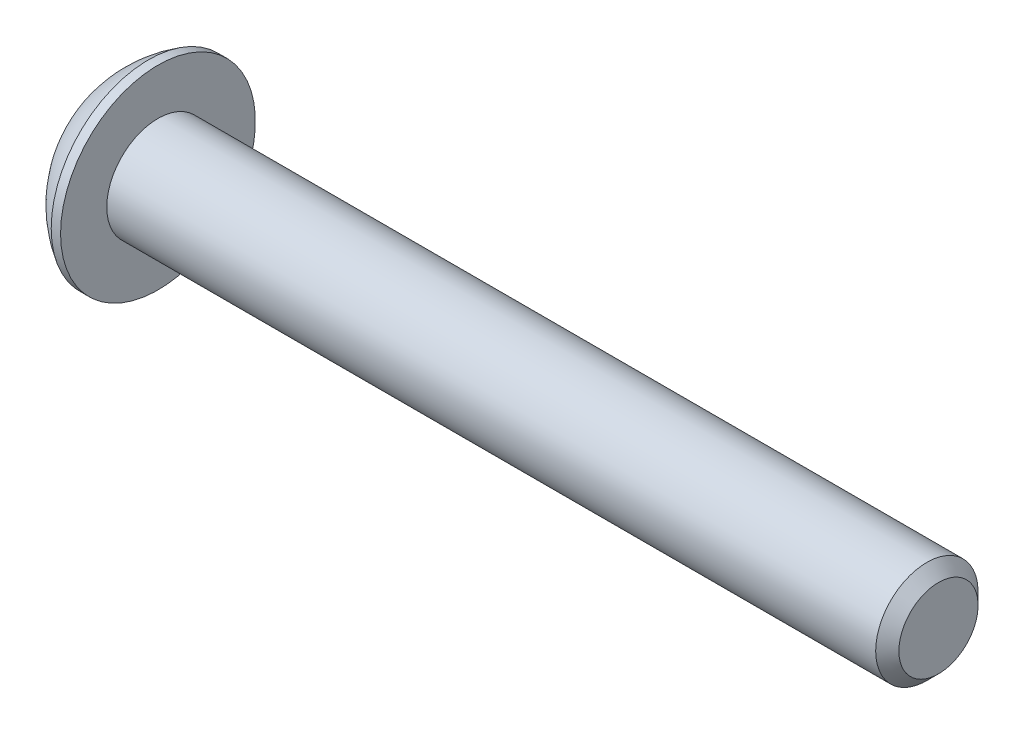
ISO-10303-21;
HEADER;
FILE_DESCRIPTION(('STEP AP214'),'2;1');
FILE_NAME('part.step','',(''),(''),'','','');
FILE_SCHEMA(('AUTOMOTIVE_DESIGN { 1 0 10303 214 1 1 1 1 }'));
ENDSEC;
DATA;
#1=APPLICATION_CONTEXT('core data for automotive mechanical design processes');
#2=APPLICATION_PROTOCOL_DEFINITION('international standard','automotive_design',2000,#1);
#3=PRODUCT_CONTEXT('',#1,'mechanical');
#4=PRODUCT('Part','Part','',(#3));
#5=PRODUCT_RELATED_PRODUCT_CATEGORY('part','',(#4));
#6=PRODUCT_DEFINITION_FORMATION('','',#4);
#7=PRODUCT_DEFINITION_CONTEXT('part definition',#1,'design');
#8=PRODUCT_DEFINITION('design','',#6,#7);
#9=PRODUCT_DEFINITION_SHAPE('','',#8);
#10=(LENGTH_UNIT() NAMED_UNIT(*) SI_UNIT(.MILLI.,.METRE.));
#11=(NAMED_UNIT(*) PLANE_ANGLE_UNIT() SI_UNIT($,.RADIAN.));
#12=(NAMED_UNIT(*) SI_UNIT($,.STERADIAN.) SOLID_ANGLE_UNIT());
#13=UNCERTAINTY_MEASURE_WITH_UNIT(LENGTH_MEASURE(1.E-05),#10,'distance_accuracy_value','');
#14=(GEOMETRIC_REPRESENTATION_CONTEXT(3) GLOBAL_UNCERTAINTY_ASSIGNED_CONTEXT((#13)) GLOBAL_UNIT_ASSIGNED_CONTEXT((#10,
#11,#12)) REPRESENTATION_CONTEXT('',''));
#15=CARTESIAN_POINT('',(0.,0.,0.));
#16=DIRECTION('',(0.,0.,1.));
#17=DIRECTION('',(1.,0.,0.));
#18=AXIS2_PLACEMENT_3D('',#15,#16,#17);
#19=CARTESIAN_POINT('',(1.32079999997359,0.,0.));
#20=DIRECTION('',(-1.,0.,0.));
#21=DIRECTION('',(0.,0.,1.));
#22=AXIS2_PLACEMENT_3D('',#19,#20,#21);
#23=CONICAL_SURFACE('',#22,1.19380000001001,1.04719755119008);
#24=CARTESIAN_POINT('',(2.0100407513155,0.,0.));
#25=VERTEX_POINT('',#24);
#26=VERTEX_LOOP('',#25);
#27=FACE_BOUND('',#26,.T.);
#28=CARTESIAN_POINT('',(1.32079999997359,0.,0.));
#29=DIRECTION('',(-1.,0.,0.));
#30=DIRECTION('',(0.,0.,1.));
#31=AXIS2_PLACEMENT_3D('',#28,#29,#30);
#32=CIRCLE('',#31,1.19380000001001);
#33=CARTESIAN_POINT('',(1.32079999998682,-1.0338611270422,0.596900000002503));
#34=VERTEX_POINT('',#33);
#35=CARTESIAN_POINT('',(1.32079999998682,0.,1.19380000000501));
#36=VERTEX_POINT('',#35);
#37=EDGE_CURVE('E92',#34,#36,#32,.T.);
#38=ORIENTED_EDGE('',*,*,#37,.T.);
#39=CARTESIAN_POINT('',(1.32079999997359,0.,0.));
#40=DIRECTION('',(-1.,0.,0.));
#41=DIRECTION('',(0.,0.,1.));
#42=AXIS2_PLACEMENT_3D('',#39,#40,#41);
#43=CIRCLE('',#42,1.19380000001001);
#44=CARTESIAN_POINT('',(1.32079999998682,1.0338611270422,0.596900000002504));
#45=VERTEX_POINT('',#44);
#46=EDGE_CURVE('E88',#36,#45,#43,.T.);
#47=ORIENTED_EDGE('',*,*,#46,.T.);
#48=CARTESIAN_POINT('',(1.32079999997359,0.,0.));
#49=DIRECTION('',(-1.,0.,0.));
#50=DIRECTION('',(0.,0.,1.));
#51=AXIS2_PLACEMENT_3D('',#48,#49,#50);
#52=CIRCLE('',#51,1.19380000001001);
#53=CARTESIAN_POINT('',(1.32079999998682,1.0338611270422,-0.596900000002504));
#54=VERTEX_POINT('',#53);
#55=EDGE_CURVE('E21',#45,#54,#52,.T.);
#56=ORIENTED_EDGE('',*,*,#55,.T.);
#57=CARTESIAN_POINT('',(1.32079999997359,0.,0.));
#58=DIRECTION('',(-1.,0.,0.));
#59=DIRECTION('',(0.,0.,1.));
#60=AXIS2_PLACEMENT_3D('',#57,#58,#59);
#61=CIRCLE('',#60,1.19380000001001);
#62=CARTESIAN_POINT('',(1.32079999998682,1.49461108489558E-12,-1.19380000000501));
#63=VERTEX_POINT('',#62);
#64=EDGE_CURVE('E151',#54,#63,#61,.T.);
#65=ORIENTED_EDGE('',*,*,#64,.T.);
#66=CARTESIAN_POINT('',(1.32079999997359,0.,0.));
#67=DIRECTION('',(-1.,0.,0.));
#68=DIRECTION('',(0.,0.,1.));
#69=AXIS2_PLACEMENT_3D('',#66,#67,#68);
#70=CIRCLE('',#69,1.19380000001001);
#71=CARTESIAN_POINT('',(1.32079999998682,-1.0338611270422,-0.596900000002503));
#72=VERTEX_POINT('',#71);
#73=EDGE_CURVE('E153',#63,#72,#70,.T.);
#74=ORIENTED_EDGE('',*,*,#73,.T.);
#75=CARTESIAN_POINT('',(1.32079999997359,0.,0.));
#76=DIRECTION('',(-1.,0.,0.));
#77=DIRECTION('',(0.,0.,1.));
#78=AXIS2_PLACEMENT_3D('',#75,#76,#77);
#79=CIRCLE('',#78,1.19380000001001);
#80=EDGE_CURVE('E155',#72,#34,#79,.T.);
#81=ORIENTED_EDGE('',*,*,#80,.T.);
#82=EDGE_LOOP('',(#38,#47,#56,#65,#74,#81));
#83=FACE_BOUND('',#82,.T.);
#84=ADVANCED_FACE('F17',(#27,#83),#23,.F.);
#85=CARTESIAN_POINT('',(1.3208,-2.06772225407572,-1.1938));
#86=DIRECTION('',(1.,0.,0.));
#87=DIRECTION('',(0.,0.,-1.));
#88=AXIS2_PLACEMENT_3D('',#85,#86,#87);
#89=PLANE('',#88);
#90=DIRECTION('',(0.,-0.5,-0.866025403784439));
#91=VECTOR('',#90,1.);
#92=CARTESIAN_POINT('',(1.32080000000004,1.37848150271715,0.));
#93=LINE('',#92,#91);
#94=CARTESIAN_POINT('',(1.32080000000001,1.37848150271715,0.));
#95=VERTEX_POINT('',#94);
#96=EDGE_CURVE('E104',#54,#95,#93,.F.);
#97=ORIENTED_EDGE('',*,*,#96,.F.);
#98=ORIENTED_EDGE('',*,*,#55,.F.);
#99=DIRECTION('',(0.,0.5,-0.866025403784439));
#100=VECTOR('',#99,1.);
#101=CARTESIAN_POINT('',(1.3208,0.689240751358576,1.1938));
#102=LINE('',#101,#100);
#103=EDGE_CURVE('E102',#95,#45,#102,.F.);
#104=ORIENTED_EDGE('',*,*,#103,.F.);
#105=EDGE_LOOP('',(#97,#98,#104));
#106=FACE_BOUND('',#105,.T.);
#107=ADVANCED_FACE('F100',(#106),#89,.F.);
#108=CARTESIAN_POINT('',(1.3208,-2.06772225407572,-1.1938));
#109=DIRECTION('',(1.,0.,0.));
#110=DIRECTION('',(0.,0.,-1.));
#111=AXIS2_PLACEMENT_3D('',#108,#109,#110);
#112=PLANE('',#111);
#113=DIRECTION('',(0.,0.5,-0.866025403784439));
#114=VECTOR('',#113,1.);
#115=CARTESIAN_POINT('',(1.32080000000004,0.689240751358576,1.1938));
#116=LINE('',#115,#114);
#117=CARTESIAN_POINT('',(1.32080000000001,0.689240751358576,1.1938));
#118=VERTEX_POINT('',#117);
#119=EDGE_CURVE('E106',#45,#118,#116,.F.);
#120=ORIENTED_EDGE('',*,*,#119,.F.);
#121=ORIENTED_EDGE('',*,*,#46,.F.);
#122=DIRECTION('',(0.,1.,0.));
#123=VECTOR('',#122,1.);
#124=CARTESIAN_POINT('',(1.3208,-0.689240751358574,1.1938));
#125=LINE('',#124,#123);
#126=EDGE_CURVE('E109',#118,#36,#125,.F.);
#127=ORIENTED_EDGE('',*,*,#126,.F.);
#128=EDGE_LOOP('',(#120,#121,#127));
#129=FACE_BOUND('',#128,.T.);
#130=ADVANCED_FACE('F107',(#129),#112,.F.);
#131=CARTESIAN_POINT('',(1.3208,-2.06772225407572,-1.1938));
#132=DIRECTION('',(1.,0.,0.));
#133=DIRECTION('',(0.,0.,-1.));
#134=AXIS2_PLACEMENT_3D('',#131,#132,#133);
#135=PLANE('',#134);
#136=DIRECTION('',(0.,1.,0.));
#137=VECTOR('',#136,1.);
#138=CARTESIAN_POINT('',(1.32080000000004,-0.689240751358574,1.1938));
#139=LINE('',#138,#137);
#140=CARTESIAN_POINT('',(1.32080000000001,-0.689240751358574,1.1938));
#141=VERTEX_POINT('',#140);
#142=EDGE_CURVE('E169',#36,#141,#139,.F.);
#143=ORIENTED_EDGE('',*,*,#142,.F.);
#144=ORIENTED_EDGE('',*,*,#37,.F.);
#145=DIRECTION('',(0.,0.5,0.866025403784439));
#146=VECTOR('',#145,1.);
#147=CARTESIAN_POINT('',(1.3208,-1.37848150271715,0.));
#148=LINE('',#147,#146);
#149=EDGE_CURVE('E167',#141,#34,#148,.F.);
#150=ORIENTED_EDGE('',*,*,#149,.F.);
#151=EDGE_LOOP('',(#143,#144,#150));
#152=FACE_BOUND('',#151,.T.);
#153=ADVANCED_FACE('F165',(#152),#135,.F.);
#154=CARTESIAN_POINT('',(1.3208,-2.06772225407572,-1.1938));
#155=DIRECTION('',(1.,0.,0.));
#156=DIRECTION('',(0.,0.,-1.));
#157=AXIS2_PLACEMENT_3D('',#154,#155,#156);
#158=PLANE('',#157);
#159=DIRECTION('',(0.,0.5,0.866025403784439));
#160=VECTOR('',#159,1.);
#161=CARTESIAN_POINT('',(1.32080000000004,-1.37848150271715,0.));
#162=LINE('',#161,#160);
#163=CARTESIAN_POINT('',(1.32080000000001,-1.37848150271715,0.));
#164=VERTEX_POINT('',#163);
#165=EDGE_CURVE('E170',#34,#164,#162,.F.);
#166=ORIENTED_EDGE('',*,*,#165,.F.);
#167=ORIENTED_EDGE('',*,*,#80,.F.);
#168=DIRECTION('',(0.,-0.5,0.866025403784439));
#169=VECTOR('',#168,1.);
#170=CARTESIAN_POINT('',(1.3208,-0.689240751358574,-1.1938));
#171=LINE('',#170,#169);
#172=EDGE_CURVE('E173',#164,#72,#171,.F.);
#173=ORIENTED_EDGE('',*,*,#172,.F.);
#174=EDGE_LOOP('',(#166,#167,#173));
#175=FACE_BOUND('',#174,.T.);
#176=ADVANCED_FACE('F171',(#175),#158,.F.);
#177=CARTESIAN_POINT('',(1.3208,-2.06772225407572,-1.1938));
#178=DIRECTION('',(1.,0.,0.));
#179=DIRECTION('',(0.,0.,-1.));
#180=AXIS2_PLACEMENT_3D('',#177,#178,#179);
#181=PLANE('',#180);
#182=DIRECTION('',(0.,-0.5,0.866025403784439));
#183=VECTOR('',#182,1.);
#184=CARTESIAN_POINT('',(1.32080000000004,-0.689240751358574,-1.1938));
#185=LINE('',#184,#183);
#186=CARTESIAN_POINT('',(1.32080000000001,-0.689240751358574,-1.1938));
#187=VERTEX_POINT('',#186);
#188=EDGE_CURVE('E228',#72,#187,#185,.F.);
#189=ORIENTED_EDGE('',*,*,#188,.F.);
#190=ORIENTED_EDGE('',*,*,#73,.F.);
#191=DIRECTION('',(0.,1.,0.));
#192=VECTOR('',#191,1.);
#193=CARTESIAN_POINT('',(1.3208,0.689240751358577,-1.1938));
#194=LINE('',#193,#192);
#195=EDGE_CURVE('E240',#187,#63,#194,.T.);
#196=ORIENTED_EDGE('',*,*,#195,.F.);
#197=EDGE_LOOP('',(#189,#190,#196));
#198=FACE_BOUND('',#197,.T.);
#199=ADVANCED_FACE('F390',(#198),#181,.F.);
#200=CARTESIAN_POINT('',(1.3208,-2.06772225407572,-1.1938));
#201=DIRECTION('',(1.,0.,0.));
#202=DIRECTION('',(0.,0.,-1.));
#203=AXIS2_PLACEMENT_3D('',#200,#201,#202);
#204=PLANE('',#203);
#205=DIRECTION('',(0.,1.,0.));
#206=VECTOR('',#205,1.);
#207=CARTESIAN_POINT('',(1.32080000000004,0.689240751358577,-1.1938));
#208=LINE('',#207,#206);
#209=CARTESIAN_POINT('',(1.32080000000002,0.689240751358565,-1.19380000000002));
#210=VERTEX_POINT('',#209);
#211=EDGE_CURVE('E248',#63,#210,#208,.T.);
#212=ORIENTED_EDGE('',*,*,#211,.F.);
#213=ORIENTED_EDGE('',*,*,#64,.F.);
#214=DIRECTION('',(0.,-0.5,-0.866025403784439));
#215=VECTOR('',#214,1.);
#216=CARTESIAN_POINT('',(1.3208,1.37848150271715,0.));
#217=LINE('',#216,#215);
#218=EDGE_CURVE('E128',#210,#54,#217,.F.);
#219=ORIENTED_EDGE('',*,*,#218,.F.);
#220=EDGE_LOOP('',(#212,#213,#219));
#221=FACE_BOUND('',#220,.T.);
#222=ADVANCED_FACE('F380',(#221),#204,.F.);
#223=CARTESIAN_POINT('',(1.3208,1.37848150271715,0.));
#224=DIRECTION('',(0.,-0.866025403784439,0.5));
#225=DIRECTION('',(0.,-0.5,-0.866025403784439));
#226=AXIS2_PLACEMENT_3D('',#223,#224,#225);
#227=PLANE('',#226);
#228=ORIENTED_EDGE('',*,*,#96,.T.);
#229=DIRECTION('',(1.,0.,0.));
#230=VECTOR('',#229,1.);
#231=CARTESIAN_POINT('',(1.3208,1.37848150271715,0.));
#232=LINE('',#231,#230);
#233=CARTESIAN_POINT('',(0.,1.37848150271715,0.));
#234=VERTEX_POINT('',#233);
#235=EDGE_CURVE('E116',#234,#95,#232,.T.);
#236=ORIENTED_EDGE('',*,*,#235,.F.);
#237=DIRECTION('',(0.,0.5,0.866025403784439));
#238=VECTOR('',#237,1.);
#239=CARTESIAN_POINT('',(0.,0.689240751358577,-1.1938));
#240=LINE('',#239,#238);
#241=CARTESIAN_POINT('',(0.,0.689240751358577,-1.1938));
#242=VERTEX_POINT('',#241);
#243=EDGE_CURVE('E131',#242,#234,#240,.T.);
#244=ORIENTED_EDGE('',*,*,#243,.F.);
#245=DIRECTION('',(1.,0.,0.));
#246=VECTOR('',#245,1.);
#247=CARTESIAN_POINT('',(1.3208,0.689240751358577,-1.1938));
#248=LINE('',#247,#246);
#249=EDGE_CURVE('E135',#210,#242,#248,.F.);
#250=ORIENTED_EDGE('',*,*,#249,.F.);
#251=ORIENTED_EDGE('',*,*,#218,.T.);
#252=EDGE_LOOP('',(#228,#236,#244,#250,#251));
#253=FACE_BOUND('',#252,.T.);
#254=ADVANCED_FACE('F371',(#253),#227,.T.);
#255=CARTESIAN_POINT('',(1.3208,0.689240751358576,1.1938));
#256=DIRECTION('',(0.,-0.866025403784439,-0.5));
#257=DIRECTION('',(0.,0.5,-0.866025403784439));
#258=AXIS2_PLACEMENT_3D('',#255,#256,#257);
#259=PLANE('',#258);
#260=ORIENTED_EDGE('',*,*,#119,.T.);
#261=DIRECTION('',(1.,0.,0.));
#262=VECTOR('',#261,1.);
#263=CARTESIAN_POINT('',(1.3208,0.689240751358576,1.1938));
#264=LINE('',#263,#262);
#265=CARTESIAN_POINT('',(0.,0.689240751358577,1.1938));
#266=VERTEX_POINT('',#265);
#267=EDGE_CURVE('E112',#266,#118,#264,.T.);
#268=ORIENTED_EDGE('',*,*,#267,.F.);
#269=DIRECTION('',(0.,-0.5,0.866025403784439));
#270=VECTOR('',#269,1.);
#271=CARTESIAN_POINT('',(0.,1.37848150271715,0.));
#272=LINE('',#271,#270);
#273=EDGE_CURVE('E134',#234,#266,#272,.T.);
#274=ORIENTED_EDGE('',*,*,#273,.F.);
#275=ORIENTED_EDGE('',*,*,#235,.T.);
#276=ORIENTED_EDGE('',*,*,#103,.T.);
#277=EDGE_LOOP('',(#260,#268,#274,#275,#276));
#278=FACE_BOUND('',#277,.T.);
#279=ADVANCED_FACE('F114',(#278),#259,.T.);
#280=CARTESIAN_POINT('',(1.3208,-0.689240751358574,1.1938));
#281=DIRECTION('',(0.,0.,-1.));
#282=DIRECTION('',(0.,1.,0.));
#283=AXIS2_PLACEMENT_3D('',#280,#281,#282);
#284=PLANE('',#283);
#285=ORIENTED_EDGE('',*,*,#142,.T.);
#286=DIRECTION('',(1.,0.,0.));
#287=VECTOR('',#286,1.);
#288=CARTESIAN_POINT('',(1.3208,-0.689240751358574,1.1938));
#289=LINE('',#288,#287);
#290=CARTESIAN_POINT('',(0.,-0.689240751358574,1.1938));
#291=VERTEX_POINT('',#290);
#292=EDGE_CURVE('E180',#291,#141,#289,.T.);
#293=ORIENTED_EDGE('',*,*,#292,.F.);
#294=DIRECTION('',(0.,1.,0.));
#295=VECTOR('',#294,1.);
#296=CARTESIAN_POINT('',(0.,0.,1.1938));
#297=LINE('',#296,#295);
#298=EDGE_CURVE('E194',#266,#291,#297,.F.);
#299=ORIENTED_EDGE('',*,*,#298,.F.);
#300=ORIENTED_EDGE('',*,*,#267,.T.);
#301=ORIENTED_EDGE('',*,*,#126,.T.);
#302=EDGE_LOOP('',(#285,#293,#299,#300,#301));
#303=FACE_BOUND('',#302,.T.);
#304=ADVANCED_FACE('F216',(#303),#284,.T.);
#305=CARTESIAN_POINT('',(1.3208,-1.37848150271715,0.));
#306=DIRECTION('',(0.,0.866025403784439,-0.5));
#307=DIRECTION('',(0.,0.5,0.866025403784439));
#308=AXIS2_PLACEMENT_3D('',#305,#306,#307);
#309=PLANE('',#308);
#310=ORIENTED_EDGE('',*,*,#165,.T.);
#311=DIRECTION('',(1.,0.,0.));
#312=VECTOR('',#311,1.);
#313=CARTESIAN_POINT('',(1.3208,-1.37848150271715,0.));
#314=LINE('',#313,#312);
#315=CARTESIAN_POINT('',(0.,-1.37848150271715,0.));
#316=VERTEX_POINT('',#315);
#317=EDGE_CURVE('E176',#316,#164,#314,.T.);
#318=ORIENTED_EDGE('',*,*,#317,.F.);
#319=DIRECTION('',(0.,-0.5,-0.866025403784439));
#320=VECTOR('',#319,1.);
#321=CARTESIAN_POINT('',(0.,-0.689240751358574,1.1938));
#322=LINE('',#321,#320);
#323=EDGE_CURVE('E197',#291,#316,#322,.T.);
#324=ORIENTED_EDGE('',*,*,#323,.F.);
#325=ORIENTED_EDGE('',*,*,#292,.T.);
#326=ORIENTED_EDGE('',*,*,#149,.T.);
#327=EDGE_LOOP('',(#310,#318,#324,#325,#326));
#328=FACE_BOUND('',#327,.T.);
#329=ADVANCED_FACE('F178',(#328),#309,.T.);
#330=CARTESIAN_POINT('',(1.3208,-0.689240751358574,-1.1938));
#331=DIRECTION('',(0.,0.866025403784439,0.5));
#332=DIRECTION('',(0.,-0.5,0.866025403784439));
#333=AXIS2_PLACEMENT_3D('',#330,#331,#332);
#334=PLANE('',#333);
#335=ORIENTED_EDGE('',*,*,#188,.T.);
#336=DIRECTION('',(1.,0.,0.));
#337=VECTOR('',#336,1.);
#338=CARTESIAN_POINT('',(1.3208,-0.689240751358574,-1.1938));
#339=LINE('',#338,#337);
#340=CARTESIAN_POINT('',(0.,-0.689240751358574,-1.1938));
#341=VERTEX_POINT('',#340);
#342=EDGE_CURVE('E36',#341,#187,#339,.T.);
#343=ORIENTED_EDGE('',*,*,#342,.F.);
#344=DIRECTION('',(0.,0.5,-0.866025403784439));
#345=VECTOR('',#344,1.);
#346=CARTESIAN_POINT('',(0.,-1.37848150271715,0.));
#347=LINE('',#346,#345);
#348=EDGE_CURVE('E217',#316,#341,#347,.T.);
#349=ORIENTED_EDGE('',*,*,#348,.F.);
#350=ORIENTED_EDGE('',*,*,#317,.T.);
#351=ORIENTED_EDGE('',*,*,#172,.T.);
#352=EDGE_LOOP('',(#335,#343,#349,#350,#351));
#353=FACE_BOUND('',#352,.T.);
#354=ADVANCED_FACE('F337',(#353),#334,.T.);
#355=CARTESIAN_POINT('',(1.3208,0.689240751358577,-1.1938));
#356=DIRECTION('',(0.,0.,1.));
#357=DIRECTION('',(1.,0.,0.));
#358=AXIS2_PLACEMENT_3D('',#355,#356,#357);
#359=PLANE('',#358);
#360=ORIENTED_EDGE('',*,*,#211,.T.);
#361=ORIENTED_EDGE('',*,*,#249,.T.);
#362=DIRECTION('',(0.,1.,0.));
#363=VECTOR('',#362,1.);
#364=CARTESIAN_POINT('',(0.,0.,-1.1938));
#365=LINE('',#364,#363);
#366=EDGE_CURVE('E150',#341,#242,#365,.T.);
#367=ORIENTED_EDGE('',*,*,#366,.F.);
#368=ORIENTED_EDGE('',*,*,#342,.T.);
#369=ORIENTED_EDGE('',*,*,#195,.T.);
#370=EDGE_LOOP('',(#360,#361,#367,#368,#369));
#371=FACE_BOUND('',#370,.T.);
#372=ADVANCED_FACE('F328',(#371),#359,.T.);
#373=CARTESIAN_POINT('',(0.,0.,0.));
#374=DIRECTION('',(-1.,0.,0.));
#375=DIRECTION('',(0.,0.,1.));
#376=AXIS2_PLACEMENT_3D('',#373,#374,#375);
#377=PLANE('',#376);
#378=CARTESIAN_POINT('',(0.,0.,0.));
#379=DIRECTION('',(-1.,0.,0.));
#380=DIRECTION('',(0.,0.,1.));
#381=AXIS2_PLACEMENT_3D('',#378,#379,#380);
#382=CIRCLE('',#381,1.9812);
#383=CARTESIAN_POINT('',(0.,0.,1.9812));
#384=VERTEX_POINT('',#383);
#385=EDGE_CURVE('E147',#384,#384,#382,.F.);
#386=ORIENTED_EDGE('',*,*,#385,.F.);
#387=EDGE_LOOP('',(#386));
#388=FACE_BOUND('',#387,.T.);
#389=ORIENTED_EDGE('',*,*,#348,.T.);
#390=ORIENTED_EDGE('',*,*,#366,.T.);
#391=ORIENTED_EDGE('',*,*,#243,.T.);
#392=ORIENTED_EDGE('',*,*,#273,.T.);
#393=ORIENTED_EDGE('',*,*,#298,.T.);
#394=ORIENTED_EDGE('',*,*,#323,.T.);
#395=EDGE_LOOP('',(#389,#390,#391,#392,#393,#394));
#396=FACE_BOUND('',#395,.T.);
#397=ADVANCED_FACE('F210',(#388,#396),#377,.T.);
#398=CARTESIAN_POINT('',(4.13385,0.,0.));
#399=DIRECTION('',(0.,1.,0.));
#400=DIRECTION('',(-0.491969836603489,0.,-0.870612244269707));
#401=AXIS2_PLACEMENT_3D('',#398,#399,#400);
#402=SPHERICAL_SURFACE('',#401,4.58408870578439);
#403=CARTESIAN_POINT('',(4.13385,0.,0.));
#404=DIRECTION('',(-1.,0.,0.));
#405=DIRECTION('',(0.,0.,1.));
#406=AXIS2_PLACEMENT_3D('',#403,#404,#405);
#407=SPHERICAL_SURFACE('',#406,4.58408870578439);
#408=ORIENTED_EDGE('',*,*,#385,.T.);
#409=EDGE_LOOP('',(#408));
#410=FACE_BOUND('',#409,.T.);
#411=CARTESIAN_POINT('',(1.8288,0.,0.));
#412=DIRECTION('',(-1.,0.,0.));
#413=DIRECTION('',(0.,0.,1.));
#414=AXIS2_PLACEMENT_3D('',#411,#412,#413);
#415=CIRCLE('',#414,3.9624);
#416=CARTESIAN_POINT('',(1.8288,0.,3.9624));
#417=VERTEX_POINT('',#416);
#418=EDGE_CURVE('E144',#417,#417,#415,.F.);
#419=ORIENTED_EDGE('',*,*,#418,.F.);
#420=EDGE_LOOP('',(#419));
#421=FACE_BOUND('',#420,.T.);
#422=ADVANCED_FACE('F19',(#410,#421),#407,.T.);
#423=CARTESIAN_POINT('',(33.9598,0.,0.));
#424=DIRECTION('',(-1.,0.,0.));
#425=DIRECTION('',(0.,0.,1.));
#426=AXIS2_PLACEMENT_3D('',#423,#424,#425);
#427=PLANE('',#426);
#428=CARTESIAN_POINT('',(33.959799999991,0.,0.));
#429=DIRECTION('',(-1.,0.,0.));
#430=DIRECTION('',(0.,0.,1.));
#431=AXIS2_PLACEMENT_3D('',#428,#429,#430);
#432=CIRCLE('',#431,1.61035999997239);
#433=CARTESIAN_POINT('',(33.959799999991,0.,1.61035999997239));
#434=VERTEX_POINT('',#433);
#435=EDGE_CURVE('E141',#434,#434,#432,.T.);
#436=ORIENTED_EDGE('',*,*,#435,.F.);
#437=EDGE_LOOP('',(#436));
#438=FACE_BOUND('',#437,.T.);
#439=ADVANCED_FACE('F270',(#438),#427,.F.);
#440=CARTESIAN_POINT('',(0.,0.,0.));
#441=DIRECTION('',(-1.,0.,0.));
#442=DIRECTION('',(0.,0.,1.));
#443=AXIS2_PLACEMENT_3D('',#440,#441,#442);
#444=CYLINDRICAL_SURFACE('',#443,3.9624);
#445=ORIENTED_EDGE('',*,*,#418,.T.);
#446=EDGE_LOOP('',(#445));
#447=FACE_BOUND('',#446,.T.);
#448=CARTESIAN_POINT('',(2.2098,0.,0.));
#449=DIRECTION('',(-1.,0.,0.));
#450=DIRECTION('',(0.,0.,1.));
#451=AXIS2_PLACEMENT_3D('',#448,#449,#450);
#452=CIRCLE('',#451,3.9624);
#453=CARTESIAN_POINT('',(2.2098,0.,3.9624));
#454=VERTEX_POINT('',#453);
#455=EDGE_CURVE('E138',#454,#454,#452,.T.);
#456=ORIENTED_EDGE('',*,*,#455,.T.);
#457=EDGE_LOOP('',(#456));
#458=FACE_BOUND('',#457,.T.);
#459=ADVANCED_FACE('F266',(#447,#458),#444,.T.);
#460=CARTESIAN_POINT('',(33.4873600000947,0.,0.));
#461=DIRECTION('',(-1.,0.,0.));
#462=DIRECTION('',(0.,0.,1.));
#463=AXIS2_PLACEMENT_3D('',#460,#461,#462);
#464=CONICAL_SURFACE('',#463,2.08279999986871,0.785398163397448);
#465=CARTESIAN_POINT('',(33.48736,0.,0.));
#466=DIRECTION('',(-1.,0.,0.));
#467=DIRECTION('',(0.,0.,1.));
#468=AXIS2_PLACEMENT_3D('',#465,#466,#467);
#469=CIRCLE('',#468,2.0828);
#470=CARTESIAN_POINT('',(33.48736,0.,2.0828));
#471=VERTEX_POINT('',#470);
#472=EDGE_CURVE('E27',#471,#471,#469,.T.);
#473=ORIENTED_EDGE('',*,*,#472,.F.);
#474=EDGE_LOOP('',(#473));
#475=FACE_BOUND('',#474,.T.);
#476=ORIENTED_EDGE('',*,*,#435,.T.);
#477=EDGE_LOOP('',(#476));
#478=FACE_BOUND('',#477,.T.);
#479=ADVANCED_FACE('F262',(#475,#478),#464,.T.);
#480=CARTESIAN_POINT('',(2.2098,2.0828,0.));
#481=DIRECTION('',(-1.,0.,0.));
#482=DIRECTION('',(0.,0.,1.));
#483=AXIS2_PLACEMENT_3D('',#480,#481,#482);
#484=PLANE('',#483);
#485=ORIENTED_EDGE('',*,*,#455,.F.);
#486=EDGE_LOOP('',(#485));
#487=FACE_BOUND('',#486,.T.);
#488=CARTESIAN_POINT('',(2.2098,0.,0.));
#489=DIRECTION('',(-1.,0.,0.));
#490=DIRECTION('',(0.,0.,1.));
#491=AXIS2_PLACEMENT_3D('',#488,#489,#490);
#492=CIRCLE('',#491,2.0828);
#493=CARTESIAN_POINT('',(2.2098,0.,2.0828));
#494=VERTEX_POINT('',#493);
#495=EDGE_CURVE('E11',#494,#494,#492,.F.);
#496=ORIENTED_EDGE('',*,*,#495,.F.);
#497=EDGE_LOOP('',(#496));
#498=FACE_BOUND('',#497,.T.);
#499=ADVANCED_FACE('F265',(#487,#498),#484,.F.);
#500=CARTESIAN_POINT('',(0.,0.,0.));
#501=DIRECTION('',(-1.,0.,0.));
#502=DIRECTION('',(0.,0.,1.));
#503=AXIS2_PLACEMENT_3D('',#500,#501,#502);
#504=CYLINDRICAL_SURFACE('',#503,2.0828);
#505=ORIENTED_EDGE('',*,*,#495,.T.);
#506=EDGE_LOOP('',(#505));
#507=FACE_BOUND('',#506,.T.);
#508=ORIENTED_EDGE('',*,*,#472,.T.);
#509=EDGE_LOOP('',(#508));
#510=FACE_BOUND('',#509,.T.);
#511=ADVANCED_FACE('F260',(#507,#510),#504,.T.);
#512=CLOSED_SHELL('',(#84,#107,#130,#153,#176,#199,#222,#254,#279,#304,#329,#354,#372,#397,#422,
#439,#459,#479,#499,#511));
#513=MANIFOLD_SOLID_BREP('B1',#512);
#514=ADVANCED_BREP_SHAPE_REPRESENTATION('',(#18,#513),#14);
#515=SHAPE_DEFINITION_REPRESENTATION(#9,#514);
ENDSEC;
END-ISO-10303-21;
